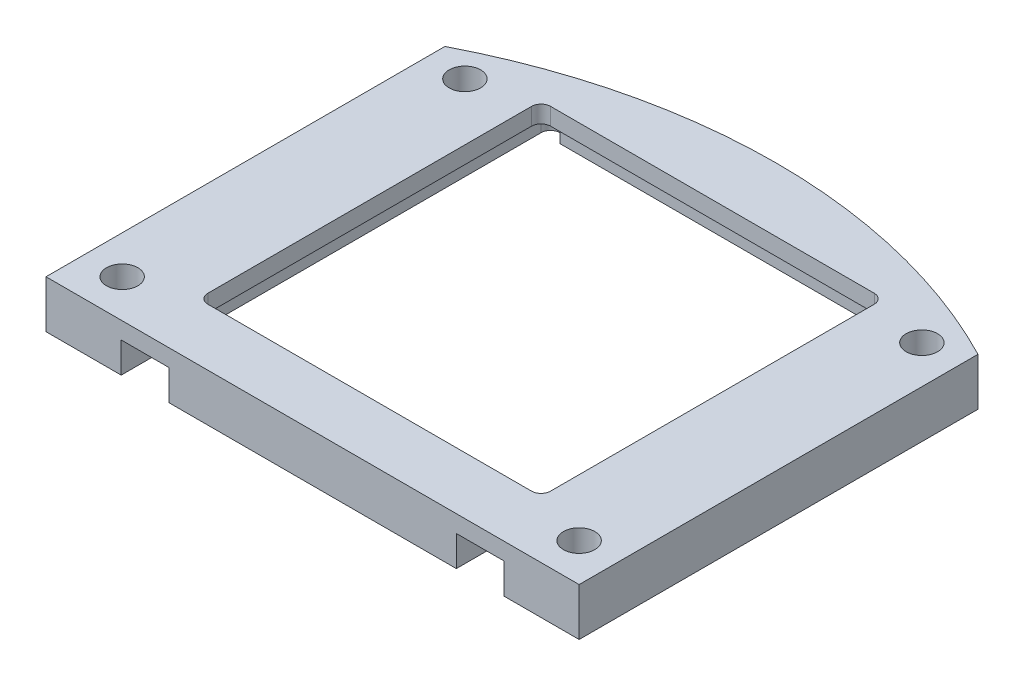
ISO-10303-21;
HEADER;
FILE_DESCRIPTION(('STEP AP214'),'2;1');
FILE_NAME('part.step','',(''),(''),'','','');
FILE_SCHEMA(('AUTOMOTIVE_DESIGN { 1 0 10303 214 1 1 1 1 }'));
ENDSEC;
DATA;
#1=APPLICATION_CONTEXT('core data for automotive mechanical design processes');
#2=APPLICATION_PROTOCOL_DEFINITION('international standard','automotive_design',2000,#1);
#3=PRODUCT_CONTEXT('',#1,'mechanical');
#4=PRODUCT('Part','Part','',(#3));
#5=PRODUCT_RELATED_PRODUCT_CATEGORY('part','',(#4));
#6=PRODUCT_DEFINITION_FORMATION('','',#4);
#7=PRODUCT_DEFINITION_CONTEXT('part definition',#1,'design');
#8=PRODUCT_DEFINITION('design','',#6,#7);
#9=PRODUCT_DEFINITION_SHAPE('','',#8);
#10=(LENGTH_UNIT() NAMED_UNIT(*) SI_UNIT(.MILLI.,.METRE.));
#11=(NAMED_UNIT(*) PLANE_ANGLE_UNIT() SI_UNIT($,.RADIAN.));
#12=(NAMED_UNIT(*) SI_UNIT($,.STERADIAN.) SOLID_ANGLE_UNIT());
#13=UNCERTAINTY_MEASURE_WITH_UNIT(LENGTH_MEASURE(1.E-05),#10,'distance_accuracy_value','');
#14=(GEOMETRIC_REPRESENTATION_CONTEXT(3) GLOBAL_UNCERTAINTY_ASSIGNED_CONTEXT((#13)) GLOBAL_UNIT_ASSIGNED_CONTEXT((#10,
#11,#12)) REPRESENTATION_CONTEXT('',''));
#15=CARTESIAN_POINT('',(0.,0.,0.));
#16=DIRECTION('',(0.,0.,1.));
#17=DIRECTION('',(1.,0.,0.));
#18=AXIS2_PLACEMENT_3D('',#15,#16,#17);
#19=CARTESIAN_POINT('',(0.,0.,36.3));
#20=DIRECTION('',(0.,1.,0.));
#21=DIRECTION('',(0.,0.,1.));
#22=AXIS2_PLACEMENT_3D('',#19,#20,#21);
#23=PLANE('',#22);
#24=CARTESIAN_POINT('',(24.,0.,20.));
#25=DIRECTION('',(0.,1.,0.));
#26=DIRECTION('',(0.,0.,1.));
#27=AXIS2_PLACEMENT_3D('',#24,#25,#26);
#28=CIRCLE('',#27,1.65);
#29=CARTESIAN_POINT('',(24.,0.,21.65));
#30=VERTEX_POINT('',#29);
#31=EDGE_CURVE('E422',#30,#30,#28,.T.);
#32=ORIENTED_EDGE('',*,*,#31,.T.);
#33=EDGE_LOOP('',(#32));
#34=FACE_BOUND('',#33,.T.);
#35=CARTESIAN_POINT('',(-24.,0.,20.));
#36=DIRECTION('',(0.,1.,0.));
#37=DIRECTION('',(0.,0.,1.));
#38=AXIS2_PLACEMENT_3D('',#35,#36,#37);
#39=CIRCLE('',#38,1.65);
#40=CARTESIAN_POINT('',(-24.,0.,21.65));
#41=VERTEX_POINT('',#40);
#42=EDGE_CURVE('E426',#41,#41,#39,.T.);
#43=ORIENTED_EDGE('',*,*,#42,.T.);
#44=EDGE_LOOP('',(#43));
#45=FACE_BOUND('',#44,.T.);
#46=CARTESIAN_POINT('',(24.,0.,-16.));
#47=DIRECTION('',(0.,1.,0.));
#48=DIRECTION('',(0.,0.,1.));
#49=AXIS2_PLACEMENT_3D('',#46,#47,#48);
#50=CIRCLE('',#49,1.65);
#51=CARTESIAN_POINT('',(24.,0.,-14.35));
#52=VERTEX_POINT('',#51);
#53=EDGE_CURVE('E432',#52,#52,#50,.T.);
#54=ORIENTED_EDGE('',*,*,#53,.T.);
#55=EDGE_LOOP('',(#54));
#56=FACE_BOUND('',#55,.T.);
#57=CARTESIAN_POINT('',(-24.,0.,-16.));
#58=DIRECTION('',(0.,1.,0.));
#59=DIRECTION('',(0.,0.,1.));
#60=AXIS2_PLACEMENT_3D('',#57,#58,#59);
#61=CIRCLE('',#60,1.65);
#62=CARTESIAN_POINT('',(-24.,0.,-14.35));
#63=VERTEX_POINT('',#62);
#64=EDGE_CURVE('E438',#63,#63,#61,.T.);
#65=ORIENTED_EDGE('',*,*,#64,.T.);
#66=EDGE_LOOP('',(#65));
#67=FACE_BOUND('',#66,.T.);
#68=CARTESIAN_POINT('',(-19.1,0.,-20.1));
#69=DIRECTION('',(0.,1.,0.));
#70=DIRECTION('',(0.,0.,1.));
#71=AXIS2_PLACEMENT_3D('',#68,#69,#70);
#72=CIRCLE('',#71,1.);
#73=CARTESIAN_POINT('',(-18.1,0.,-20.1));
#74=VERTEX_POINT('',#73);
#75=CARTESIAN_POINT('',(-19.1,0.,-21.1));
#76=VERTEX_POINT('',#75);
#77=EDGE_CURVE('E56',#74,#76,#72,.T.);
#78=ORIENTED_EDGE('',*,*,#77,.T.);
#79=CARTESIAN_POINT('',(-19.1,0.,-20.1));
#80=DIRECTION('',(0.,1.,0.));
#81=DIRECTION('',(0.,0.,1.));
#82=AXIS2_PLACEMENT_3D('',#79,#80,#81);
#83=CIRCLE('',#82,1.);
#84=CARTESIAN_POINT('',(-20.1,0.,-20.1));
#85=VERTEX_POINT('',#84);
#86=EDGE_CURVE('E310',#76,#85,#83,.T.);
#87=ORIENTED_EDGE('',*,*,#86,.T.);
#88=DIRECTION('',(0.,0.,1.));
#89=VECTOR('',#88,1.);
#90=CARTESIAN_POINT('',(-20.1,0.,-21.1));
#91=LINE('',#90,#89);
#92=CARTESIAN_POINT('',(-20.1,0.,24.));
#93=VERTEX_POINT('',#92);
#94=EDGE_CURVE('E227',#85,#93,#91,.T.);
#95=ORIENTED_EDGE('',*,*,#94,.T.);
#96=DIRECTION('',(1.,0.,0.));
#97=VECTOR('',#96,1.);
#98=CARTESIAN_POINT('',(-28.,0.,24.));
#99=LINE('',#98,#97);
#100=CARTESIAN_POINT('',(-28.,0.,24.));
#101=VERTEX_POINT('',#100);
#102=EDGE_CURVE('E247',#101,#93,#99,.T.);
#103=ORIENTED_EDGE('',*,*,#102,.F.);
#104=DIRECTION('',(0.,0.,1.));
#105=VECTOR('',#104,1.);
#106=CARTESIAN_POINT('',(-28.,0.,24.));
#107=LINE('',#106,#105);
#108=CARTESIAN_POINT('',(-28.,0.,-17.8957039195818));
#109=VERTEX_POINT('',#108);
#110=EDGE_CURVE('E258',#109,#101,#107,.T.);
#111=ORIENTED_EDGE('',*,*,#110,.F.);
#112=CARTESIAN_POINT('',(0.,0.,36.3));
#113=DIRECTION('',(0.,1.,0.));
#114=DIRECTION('',(0.,0.,1.));
#115=AXIS2_PLACEMENT_3D('',#112,#113,#114);
#116=CIRCLE('',#115,61.0014288630928);
#117=CARTESIAN_POINT('',(28.,0.,-17.8957039195818));
#118=VERTEX_POINT('',#117);
#119=EDGE_CURVE('E256',#118,#109,#116,.T.);
#120=ORIENTED_EDGE('',*,*,#119,.F.);
#121=DIRECTION('',(0.,0.,-1.));
#122=VECTOR('',#121,1.);
#123=CARTESIAN_POINT('',(28.,0.,24.));
#124=LINE('',#123,#122);
#125=CARTESIAN_POINT('',(28.,0.,24.));
#126=VERTEX_POINT('',#125);
#127=EDGE_CURVE('E242',#126,#118,#124,.T.);
#128=ORIENTED_EDGE('',*,*,#127,.F.);
#129=CARTESIAN_POINT('',(20.1,0.,24.));
#130=VERTEX_POINT('',#129);
#131=EDGE_CURVE('E260',#130,#126,#99,.T.);
#132=ORIENTED_EDGE('',*,*,#131,.F.);
#133=DIRECTION('',(0.,0.,-1.));
#134=VECTOR('',#133,1.);
#135=CARTESIAN_POINT('',(20.1,0.,20.1));
#136=LINE('',#135,#134);
#137=CARTESIAN_POINT('',(20.1,0.,-20.1));
#138=VERTEX_POINT('',#137);
#139=EDGE_CURVE('E226',#130,#138,#136,.T.);
#140=ORIENTED_EDGE('',*,*,#139,.T.);
#141=CARTESIAN_POINT('',(19.1,0.,-20.1));
#142=DIRECTION('',(0.,1.,0.));
#143=DIRECTION('',(0.,0.,1.));
#144=AXIS2_PLACEMENT_3D('',#141,#142,#143);
#145=CIRCLE('',#144,1.);
#146=CARTESIAN_POINT('',(19.1,0.,-21.1));
#147=VERTEX_POINT('',#146);
#148=EDGE_CURVE('E63',#138,#147,#145,.T.);
#149=ORIENTED_EDGE('',*,*,#148,.T.);
#150=CARTESIAN_POINT('',(19.1,0.,-20.1));
#151=DIRECTION('',(0.,1.,0.));
#152=DIRECTION('',(0.,0.,1.));
#153=AXIS2_PLACEMENT_3D('',#150,#151,#152);
#154=CIRCLE('',#153,1.);
#155=CARTESIAN_POINT('',(18.1,0.,-20.1));
#156=VERTEX_POINT('',#155);
#157=EDGE_CURVE('E306',#147,#156,#154,.T.);
#158=ORIENTED_EDGE('',*,*,#157,.T.);
#159=DIRECTION('',(-1.,0.,0.));
#160=VECTOR('',#159,1.);
#161=CARTESIAN_POINT('',(-18.1,0.,-20.1));
#162=LINE('',#161,#160);
#163=EDGE_CURVE('E229',#156,#74,#162,.T.);
#164=ORIENTED_EDGE('',*,*,#163,.T.);
#165=EDGE_LOOP('',(#78,#87,#95,#103,#111,#120,#128,#132,#140,#149,#158,#164));
#166=FACE_BOUND('',#165,.T.);
#167=ADVANCED_FACE('F39',(#34,#45,#56,#67,#166),#23,.F.);
#168=CARTESIAN_POINT('',(-20.1,5.,-21.1));
#169=DIRECTION('',(1.,0.,0.));
#170=DIRECTION('',(0.,0.,-1.));
#171=AXIS2_PLACEMENT_3D('',#168,#169,#170);
#172=PLANE('',#171);
#173=ORIENTED_EDGE('',*,*,#94,.F.);
#174=DIRECTION('',(0.,-1.,0.));
#175=VECTOR('',#174,1.);
#176=CARTESIAN_POINT('',(-20.1,3.2,-20.1));
#177=LINE('',#176,#175);
#178=CARTESIAN_POINT('',(-20.1,3.2,-20.1));
#179=VERTEX_POINT('',#178);
#180=EDGE_CURVE('E284',#85,#179,#177,.F.);
#181=ORIENTED_EDGE('',*,*,#180,.T.);
#182=DIRECTION('',(0.,0.,1.));
#183=VECTOR('',#182,1.);
#184=CARTESIAN_POINT('',(-20.1,3.2,-21.1));
#185=LINE('',#184,#183);
#186=CARTESIAN_POINT('',(-20.1,3.2,24.));
#187=VERTEX_POINT('',#186);
#188=EDGE_CURVE('E348',#179,#187,#185,.T.);
#189=ORIENTED_EDGE('',*,*,#188,.T.);
#190=DIRECTION('',(0.,-1.,0.));
#191=VECTOR('',#190,1.);
#192=CARTESIAN_POINT('',(-20.1,0.,24.));
#193=LINE('',#192,#191);
#194=EDGE_CURVE('E221',#187,#93,#193,.T.);
#195=ORIENTED_EDGE('',*,*,#194,.T.);
#196=EDGE_LOOP('',(#173,#181,#189,#195));
#197=FACE_BOUND('',#196,.T.);
#198=ADVANCED_FACE('F345',(#197),#172,.T.);
#199=CARTESIAN_POINT('',(-20.1,5.,20.1));
#200=DIRECTION('',(0.,0.,-1.));
#201=DIRECTION('',(-1.,0.,0.));
#202=AXIS2_PLACEMENT_3D('',#199,#200,#201);
#203=PLANE('',#202);
#204=DIRECTION('',(0.,1.,0.));
#205=VECTOR('',#204,1.);
#206=CARTESIAN_POINT('',(-15.1,0.,20.1));
#207=LINE('',#206,#205);
#208=CARTESIAN_POINT('',(-15.1,0.,20.1));
#209=VERTEX_POINT('',#208);
#210=CARTESIAN_POINT('',(-15.1,3.2,20.1));
#211=VERTEX_POINT('',#210);
#212=EDGE_CURVE('E200',#209,#211,#207,.T.);
#213=ORIENTED_EDGE('',*,*,#212,.T.);
#214=DIRECTION('',(1.,0.,0.));
#215=VECTOR('',#214,1.);
#216=CARTESIAN_POINT('',(-20.1,3.2,20.1));
#217=LINE('',#216,#215);
#218=CARTESIAN_POINT('',(15.1,3.2,20.1));
#219=VERTEX_POINT('',#218);
#220=EDGE_CURVE('E414',#211,#219,#217,.T.);
#221=ORIENTED_EDGE('',*,*,#220,.T.);
#222=DIRECTION('',(0.,-1.,0.));
#223=VECTOR('',#222,1.);
#224=CARTESIAN_POINT('',(15.1,0.,20.1));
#225=LINE('',#224,#223);
#226=CARTESIAN_POINT('',(15.1,0.,20.1));
#227=VERTEX_POINT('',#226);
#228=EDGE_CURVE('E211',#219,#227,#225,.T.);
#229=ORIENTED_EDGE('',*,*,#228,.T.);
#230=DIRECTION('',(1.,0.,0.));
#231=VECTOR('',#230,1.);
#232=CARTESIAN_POINT('',(-20.1,0.,20.1));
#233=LINE('',#232,#231);
#234=EDGE_CURVE('E218',#209,#227,#233,.T.);
#235=ORIENTED_EDGE('',*,*,#234,.F.);
#236=EDGE_LOOP('',(#213,#221,#229,#235));
#237=FACE_BOUND('',#236,.T.);
#238=ADVANCED_FACE('F224',(#237),#203,.T.);
#239=CARTESIAN_POINT('',(20.1,5.,20.1));
#240=DIRECTION('',(-1.,0.,0.));
#241=DIRECTION('',(0.,0.,1.));
#242=AXIS2_PLACEMENT_3D('',#239,#240,#241);
#243=PLANE('',#242);
#244=DIRECTION('',(0.,0.,-1.));
#245=VECTOR('',#244,1.);
#246=CARTESIAN_POINT('',(20.1,3.2,20.1));
#247=LINE('',#246,#245);
#248=CARTESIAN_POINT('',(20.1,3.2,24.));
#249=VERTEX_POINT('',#248);
#250=CARTESIAN_POINT('',(20.1,3.2,-20.1));
#251=VERTEX_POINT('',#250);
#252=EDGE_CURVE('E416',#249,#251,#247,.T.);
#253=ORIENTED_EDGE('',*,*,#252,.T.);
#254=DIRECTION('',(0.,-1.,0.));
#255=VECTOR('',#254,1.);
#256=CARTESIAN_POINT('',(20.1,0.,-20.1));
#257=LINE('',#256,#255);
#258=EDGE_CURVE('E282',#251,#138,#257,.T.);
#259=ORIENTED_EDGE('',*,*,#258,.T.);
#260=ORIENTED_EDGE('',*,*,#139,.F.);
#261=DIRECTION('',(0.,1.,0.));
#262=VECTOR('',#261,1.);
#263=CARTESIAN_POINT('',(20.1,0.,24.));
#264=LINE('',#263,#262);
#265=EDGE_CURVE('E383',#130,#249,#264,.T.);
#266=ORIENTED_EDGE('',*,*,#265,.T.);
#267=EDGE_LOOP('',(#253,#259,#260,#266));
#268=FACE_BOUND('',#267,.T.);
#269=ADVANCED_FACE('F485',(#268),#243,.T.);
#270=CARTESIAN_POINT('',(-18.1,5.,-20.1));
#271=DIRECTION('',(0.,0.,1.));
#272=DIRECTION('',(1.,0.,0.));
#273=AXIS2_PLACEMENT_3D('',#270,#271,#272);
#274=PLANE('',#273);
#275=DIRECTION('',(0.,-1.,0.));
#276=VECTOR('',#275,1.);
#277=CARTESIAN_POINT('',(18.1,5.,-20.1));
#278=LINE('',#277,#276);
#279=CARTESIAN_POINT('',(18.1,3.2,-20.1));
#280=VERTEX_POINT('',#279);
#281=EDGE_CURVE('E239',#280,#156,#278,.T.);
#282=ORIENTED_EDGE('',*,*,#281,.F.);
#283=DIRECTION('',(-1.,0.,0.));
#284=VECTOR('',#283,1.);
#285=CARTESIAN_POINT('',(18.1,3.2,-20.1));
#286=LINE('',#285,#284);
#287=CARTESIAN_POINT('',(-18.1,3.2,-20.1));
#288=VERTEX_POINT('',#287);
#289=EDGE_CURVE('E419',#280,#288,#286,.T.);
#290=ORIENTED_EDGE('',*,*,#289,.T.);
#291=DIRECTION('',(0.,-1.,0.));
#292=VECTOR('',#291,1.);
#293=CARTESIAN_POINT('',(-18.1,5.,-20.1));
#294=LINE('',#293,#292);
#295=EDGE_CURVE('E236',#288,#74,#294,.T.);
#296=ORIENTED_EDGE('',*,*,#295,.T.);
#297=ORIENTED_EDGE('',*,*,#163,.F.);
#298=EDGE_LOOP('',(#282,#290,#296,#297));
#299=FACE_BOUND('',#298,.T.);
#300=ADVANCED_FACE('F479',(#299),#274,.T.);
#301=CARTESIAN_POINT('',(0.,5.,36.3));
#302=DIRECTION('',(0.,1.,0.));
#303=DIRECTION('',(0.,0.,1.));
#304=AXIS2_PLACEMENT_3D('',#301,#302,#303);
#305=PLANE('',#304);
#306=CARTESIAN_POINT('',(-24.,5.,20.));
#307=DIRECTION('',(0.,1.,0.));
#308=DIRECTION('',(0.,0.,1.));
#309=AXIS2_PLACEMENT_3D('',#306,#307,#308);
#310=CIRCLE('',#309,1.65);
#311=CARTESIAN_POINT('',(-24.,5.,21.65));
#312=VERTEX_POINT('',#311);
#313=EDGE_CURVE('E429',#312,#312,#310,.T.);
#314=ORIENTED_EDGE('',*,*,#313,.F.);
#315=EDGE_LOOP('',(#314));
#316=FACE_BOUND('',#315,.T.);
#317=CARTESIAN_POINT('',(-24.,5.,-16.));
#318=DIRECTION('',(0.,1.,0.));
#319=DIRECTION('',(0.,0.,1.));
#320=AXIS2_PLACEMENT_3D('',#317,#318,#319);
#321=CIRCLE('',#320,1.65);
#322=CARTESIAN_POINT('',(-24.,5.,-14.35));
#323=VERTEX_POINT('',#322);
#324=EDGE_CURVE('E231',#323,#323,#321,.T.);
#325=ORIENTED_EDGE('',*,*,#324,.F.);
#326=EDGE_LOOP('',(#325));
#327=FACE_BOUND('',#326,.T.);
#328=DIRECTION('',(0.,0.,-1.));
#329=VECTOR('',#328,1.);
#330=CARTESIAN_POINT('',(28.,5.,24.));
#331=LINE('',#330,#329);
#332=CARTESIAN_POINT('',(28.,5.,24.));
#333=VERTEX_POINT('',#332);
#334=CARTESIAN_POINT('',(28.,5.,-17.8957039195818));
#335=VERTEX_POINT('',#334);
#336=EDGE_CURVE('E243',#333,#335,#331,.T.);
#337=ORIENTED_EDGE('',*,*,#336,.T.);
#338=CARTESIAN_POINT('',(0.,5.,36.3));
#339=DIRECTION('',(0.,1.,0.));
#340=DIRECTION('',(0.,0.,1.));
#341=AXIS2_PLACEMENT_3D('',#338,#339,#340);
#342=CIRCLE('',#341,61.0014288630928);
#343=CARTESIAN_POINT('',(-28.,5.,-17.8957039195818));
#344=VERTEX_POINT('',#343);
#345=EDGE_CURVE('E246',#335,#344,#342,.T.);
#346=ORIENTED_EDGE('',*,*,#345,.T.);
#347=DIRECTION('',(0.,0.,1.));
#348=VECTOR('',#347,1.);
#349=CARTESIAN_POINT('',(-28.,5.,24.));
#350=LINE('',#349,#348);
#351=CARTESIAN_POINT('',(-28.,5.,24.));
#352=VERTEX_POINT('',#351);
#353=EDGE_CURVE('E249',#344,#352,#350,.T.);
#354=ORIENTED_EDGE('',*,*,#353,.T.);
#355=DIRECTION('',(1.,0.,0.));
#356=VECTOR('',#355,1.);
#357=CARTESIAN_POINT('',(-28.,5.,24.));
#358=LINE('',#357,#356);
#359=EDGE_CURVE('E251',#352,#333,#358,.T.);
#360=ORIENTED_EDGE('',*,*,#359,.T.);
#361=EDGE_LOOP('',(#337,#346,#354,#360));
#362=FACE_BOUND('',#361,.T.);
#363=CARTESIAN_POINT('',(24.,5.,-16.));
#364=DIRECTION('',(0.,1.,0.));
#365=DIRECTION('',(0.,0.,1.));
#366=AXIS2_PLACEMENT_3D('',#363,#364,#365);
#367=CIRCLE('',#366,1.65);
#368=CARTESIAN_POINT('',(24.,5.,-14.35));
#369=VERTEX_POINT('',#368);
#370=EDGE_CURVE('E435',#369,#369,#367,.T.);
#371=ORIENTED_EDGE('',*,*,#370,.F.);
#372=EDGE_LOOP('',(#371));
#373=FACE_BOUND('',#372,.T.);
#374=CARTESIAN_POINT('',(24.,5.,20.));
#375=DIRECTION('',(0.,1.,0.));
#376=DIRECTION('',(0.,0.,1.));
#377=AXIS2_PLACEMENT_3D('',#374,#375,#376);
#378=CIRCLE('',#377,1.65);
#379=CARTESIAN_POINT('',(24.,5.,21.65));
#380=VERTEX_POINT('',#379);
#381=EDGE_CURVE('E423',#380,#380,#378,.T.);
#382=ORIENTED_EDGE('',*,*,#381,.F.);
#383=EDGE_LOOP('',(#382));
#384=FACE_BOUND('',#383,.T.);
#385=DIRECTION('',(0.,0.,1.));
#386=VECTOR('',#385,1.);
#387=CARTESIAN_POINT('',(-18.,5.,-18.));
#388=LINE('',#387,#386);
#389=CARTESIAN_POINT('',(-18.,5.,-17.));
#390=VERTEX_POINT('',#389);
#391=CARTESIAN_POINT('',(-18.,5.,17.));
#392=VERTEX_POINT('',#391);
#393=EDGE_CURVE('E376',#390,#392,#388,.T.);
#394=ORIENTED_EDGE('',*,*,#393,.F.);
#395=CARTESIAN_POINT('',(-17.,5.,-17.));
#396=DIRECTION('',(0.,1.,0.));
#397=DIRECTION('',(0.,0.,1.));
#398=AXIS2_PLACEMENT_3D('',#395,#396,#397);
#399=CIRCLE('',#398,1.);
#400=CARTESIAN_POINT('',(-17.,5.,-18.));
#401=VERTEX_POINT('',#400);
#402=EDGE_CURVE('E48',#390,#401,#399,.F.);
#403=ORIENTED_EDGE('',*,*,#402,.T.);
#404=DIRECTION('',(-1.,0.,0.));
#405=VECTOR('',#404,1.);
#406=CARTESIAN_POINT('',(18.,5.,-18.));
#407=LINE('',#406,#405);
#408=CARTESIAN_POINT('',(17.,5.,-18.));
#409=VERTEX_POINT('',#408);
#410=EDGE_CURVE('E394',#409,#401,#407,.T.);
#411=ORIENTED_EDGE('',*,*,#410,.F.);
#412=CARTESIAN_POINT('',(17.,5.,-17.));
#413=DIRECTION('',(0.,1.,0.));
#414=DIRECTION('',(0.,0.,1.));
#415=AXIS2_PLACEMENT_3D('',#412,#413,#414);
#416=CIRCLE('',#415,1.);
#417=CARTESIAN_POINT('',(18.,5.,-17.));
#418=VERTEX_POINT('',#417);
#419=EDGE_CURVE('E320',#409,#418,#416,.F.);
#420=ORIENTED_EDGE('',*,*,#419,.T.);
#421=DIRECTION('',(0.,0.,-1.));
#422=VECTOR('',#421,1.);
#423=CARTESIAN_POINT('',(18.,5.,18.));
#424=LINE('',#423,#422);
#425=CARTESIAN_POINT('',(18.,5.,17.));
#426=VERTEX_POINT('',#425);
#427=EDGE_CURVE('E408',#426,#418,#424,.T.);
#428=ORIENTED_EDGE('',*,*,#427,.F.);
#429=CARTESIAN_POINT('',(17.,5.,17.));
#430=DIRECTION('',(0.,1.,0.));
#431=DIRECTION('',(0.,0.,1.));
#432=AXIS2_PLACEMENT_3D('',#429,#430,#431);
#433=CIRCLE('',#432,1.);
#434=CARTESIAN_POINT('',(17.,5.,18.));
#435=VERTEX_POINT('',#434);
#436=EDGE_CURVE('E316',#426,#435,#433,.F.);
#437=ORIENTED_EDGE('',*,*,#436,.T.);
#438=DIRECTION('',(1.,0.,0.));
#439=VECTOR('',#438,1.);
#440=CARTESIAN_POINT('',(-18.,5.,18.));
#441=LINE('',#440,#439);
#442=CARTESIAN_POINT('',(-17.,5.,18.));
#443=VERTEX_POINT('',#442);
#444=EDGE_CURVE('E405',#443,#435,#441,.T.);
#445=ORIENTED_EDGE('',*,*,#444,.F.);
#446=CARTESIAN_POINT('',(-17.,5.,17.));
#447=DIRECTION('',(0.,1.,0.));
#448=DIRECTION('',(0.,0.,1.));
#449=AXIS2_PLACEMENT_3D('',#446,#447,#448);
#450=CIRCLE('',#449,1.);
#451=EDGE_CURVE('E312',#443,#392,#450,.F.);
#452=ORIENTED_EDGE('',*,*,#451,.T.);
#453=EDGE_LOOP('',(#394,#403,#411,#420,#428,#437,#445,#452));
#454=FACE_BOUND('',#453,.T.);
#455=ADVANCED_FACE('F472',(#316,#327,#362,#373,#384,#454),#305,.T.);
#456=CARTESIAN_POINT('',(-15.1,0.,24.));
#457=VERTEX_POINT('',#456);
#458=CARTESIAN_POINT('',(15.1,0.,24.));
#459=VERTEX_POINT('',#458);
#460=EDGE_CURVE('E220',#457,#459,#99,.T.);
#461=ORIENTED_EDGE('',*,*,#460,.F.);
#462=DIRECTION('',(0.,0.,1.));
#463=VECTOR('',#462,1.);
#464=CARTESIAN_POINT('',(-15.1,0.,-24.7024288630928));
#465=LINE('',#464,#463);
#466=EDGE_CURVE('E204',#209,#457,#465,.T.);
#467=ORIENTED_EDGE('',*,*,#466,.F.);
#468=ORIENTED_EDGE('',*,*,#234,.T.);
#469=DIRECTION('',(0.,0.,1.));
#470=VECTOR('',#469,1.);
#471=CARTESIAN_POINT('',(15.1,0.,-24.7024288630928));
#472=LINE('',#471,#470);
#473=EDGE_CURVE('E382',#227,#459,#472,.T.);
#474=ORIENTED_EDGE('',*,*,#473,.T.);
#475=EDGE_LOOP('',(#461,#467,#468,#474));
#476=FACE_BOUND('',#475,.T.);
#477=ADVANCED_FACE('F216',(#476),#23,.F.);
#478=CARTESIAN_POINT('',(28.,5.,24.));
#479=DIRECTION('',(-1.,0.,0.));
#480=DIRECTION('',(0.,0.,1.));
#481=AXIS2_PLACEMENT_3D('',#478,#479,#480);
#482=PLANE('',#481);
#483=ORIENTED_EDGE('',*,*,#127,.T.);
#484=DIRECTION('',(0.,-1.,0.));
#485=VECTOR('',#484,1.);
#486=CARTESIAN_POINT('',(28.,5.,-17.8957039195818));
#487=LINE('',#486,#485);
#488=EDGE_CURVE('E271',#335,#118,#487,.T.);
#489=ORIENTED_EDGE('',*,*,#488,.F.);
#490=ORIENTED_EDGE('',*,*,#336,.F.);
#491=DIRECTION('',(0.,-1.,0.));
#492=VECTOR('',#491,1.);
#493=CARTESIAN_POINT('',(28.,5.,24.));
#494=LINE('',#493,#492);
#495=EDGE_CURVE('E253',#333,#126,#494,.T.);
#496=ORIENTED_EDGE('',*,*,#495,.T.);
#497=EDGE_LOOP('',(#483,#489,#490,#496));
#498=FACE_BOUND('',#497,.T.);
#499=ADVANCED_FACE('F368',(#498),#482,.F.);
#500=CARTESIAN_POINT('',(0.,5.,36.3));
#501=DIRECTION('',(0.,-1.,0.));
#502=DIRECTION('',(0.,0.,-1.));
#503=AXIS2_PLACEMENT_3D('',#500,#501,#502);
#504=CYLINDRICAL_SURFACE('',#503,61.0014288630928);
#505=ORIENTED_EDGE('',*,*,#119,.T.);
#506=DIRECTION('',(0.,-1.,0.));
#507=VECTOR('',#506,1.);
#508=CARTESIAN_POINT('',(-28.,5.,-17.8957039195818));
#509=LINE('',#508,#507);
#510=EDGE_CURVE('E268',#344,#109,#509,.T.);
#511=ORIENTED_EDGE('',*,*,#510,.F.);
#512=ORIENTED_EDGE('',*,*,#345,.F.);
#513=ORIENTED_EDGE('',*,*,#488,.T.);
#514=EDGE_LOOP('',(#505,#511,#512,#513));
#515=FACE_BOUND('',#514,.T.);
#516=ADVANCED_FACE('F364',(#515),#504,.T.);
#517=CARTESIAN_POINT('',(-28.,5.,24.));
#518=DIRECTION('',(1.,0.,0.));
#519=DIRECTION('',(0.,0.,-1.));
#520=AXIS2_PLACEMENT_3D('',#517,#518,#519);
#521=PLANE('',#520);
#522=ORIENTED_EDGE('',*,*,#110,.T.);
#523=DIRECTION('',(0.,-1.,0.));
#524=VECTOR('',#523,1.);
#525=CARTESIAN_POINT('',(-28.,5.,24.));
#526=LINE('',#525,#524);
#527=EDGE_CURVE('E265',#352,#101,#526,.T.);
#528=ORIENTED_EDGE('',*,*,#527,.F.);
#529=ORIENTED_EDGE('',*,*,#353,.F.);
#530=ORIENTED_EDGE('',*,*,#510,.T.);
#531=EDGE_LOOP('',(#522,#528,#529,#530));
#532=FACE_BOUND('',#531,.T.);
#533=ADVANCED_FACE('F360',(#532),#521,.F.);
#534=CARTESIAN_POINT('',(-28.,5.,24.));
#535=DIRECTION('',(0.,0.,-1.));
#536=DIRECTION('',(-1.,0.,0.));
#537=AXIS2_PLACEMENT_3D('',#534,#535,#536);
#538=PLANE('',#537);
#539=ORIENTED_EDGE('',*,*,#102,.T.);
#540=ORIENTED_EDGE('',*,*,#194,.F.);
#541=DIRECTION('',(-1.,0.,0.));
#542=VECTOR('',#541,1.);
#543=CARTESIAN_POINT('',(-20.1,3.2,24.));
#544=LINE('',#543,#542);
#545=CARTESIAN_POINT('',(-15.1,3.2,24.));
#546=VERTEX_POINT('',#545);
#547=EDGE_CURVE('E374',#546,#187,#544,.T.);
#548=ORIENTED_EDGE('',*,*,#547,.F.);
#549=DIRECTION('',(0.,1.,0.));
#550=VECTOR('',#549,1.);
#551=CARTESIAN_POINT('',(-15.1,0.,24.));
#552=LINE('',#551,#550);
#553=EDGE_CURVE('E352',#457,#546,#552,.T.);
#554=ORIENTED_EDGE('',*,*,#553,.F.);
#555=ORIENTED_EDGE('',*,*,#460,.T.);
#556=DIRECTION('',(0.,-1.,0.));
#557=VECTOR('',#556,1.);
#558=CARTESIAN_POINT('',(15.1,0.,24.));
#559=LINE('',#558,#557);
#560=CARTESIAN_POINT('',(15.1,3.2,24.));
#561=VERTEX_POINT('',#560);
#562=EDGE_CURVE('E326',#561,#459,#559,.T.);
#563=ORIENTED_EDGE('',*,*,#562,.F.);
#564=DIRECTION('',(-1.,0.,0.));
#565=VECTOR('',#564,1.);
#566=CARTESIAN_POINT('',(20.1,3.2,24.));
#567=LINE('',#566,#565);
#568=EDGE_CURVE('E329',#249,#561,#567,.T.);
#569=ORIENTED_EDGE('',*,*,#568,.F.);
#570=ORIENTED_EDGE('',*,*,#265,.F.);
#571=ORIENTED_EDGE('',*,*,#131,.T.);
#572=ORIENTED_EDGE('',*,*,#495,.F.);
#573=ORIENTED_EDGE('',*,*,#359,.F.);
#574=ORIENTED_EDGE('',*,*,#527,.T.);
#575=EDGE_LOOP('',(#539,#540,#548,#554,#555,#563,#569,#570,#571,#572,#573,#574));
#576=FACE_BOUND('',#575,.T.);
#577=ADVANCED_FACE('F354',(#576),#538,.F.);
#578=CARTESIAN_POINT('',(-24.,5.,-16.));
#579=DIRECTION('',(0.,-1.,0.));
#580=DIRECTION('',(0.,0.,-1.));
#581=AXIS2_PLACEMENT_3D('',#578,#579,#580);
#582=CYLINDRICAL_SURFACE('',#581,1.65);
#583=ORIENTED_EDGE('',*,*,#324,.T.);
#584=EDGE_LOOP('',(#583));
#585=FACE_BOUND('',#584,.T.);
#586=ORIENTED_EDGE('',*,*,#64,.F.);
#587=EDGE_LOOP('',(#586));
#588=FACE_BOUND('',#587,.T.);
#589=ADVANCED_FACE('F446',(#585,#588),#582,.F.);
#590=CARTESIAN_POINT('',(24.,5.,-16.));
#591=DIRECTION('',(0.,-1.,0.));
#592=DIRECTION('',(0.,0.,-1.));
#593=AXIS2_PLACEMENT_3D('',#590,#591,#592);
#594=CYLINDRICAL_SURFACE('',#593,1.65);
#595=ORIENTED_EDGE('',*,*,#370,.T.);
#596=EDGE_LOOP('',(#595));
#597=FACE_BOUND('',#596,.T.);
#598=ORIENTED_EDGE('',*,*,#53,.F.);
#599=EDGE_LOOP('',(#598));
#600=FACE_BOUND('',#599,.T.);
#601=ADVANCED_FACE('F448',(#597,#600),#594,.F.);
#602=CARTESIAN_POINT('',(-24.,5.,20.));
#603=DIRECTION('',(0.,-1.,0.));
#604=DIRECTION('',(0.,0.,-1.));
#605=AXIS2_PLACEMENT_3D('',#602,#603,#604);
#606=CYLINDRICAL_SURFACE('',#605,1.65);
#607=ORIENTED_EDGE('',*,*,#313,.T.);
#608=EDGE_LOOP('',(#607));
#609=FACE_BOUND('',#608,.T.);
#610=ORIENTED_EDGE('',*,*,#42,.F.);
#611=EDGE_LOOP('',(#610));
#612=FACE_BOUND('',#611,.T.);
#613=ADVANCED_FACE('F455',(#609,#612),#606,.F.);
#614=CARTESIAN_POINT('',(24.,5.,20.));
#615=DIRECTION('',(0.,-1.,0.));
#616=DIRECTION('',(0.,0.,-1.));
#617=AXIS2_PLACEMENT_3D('',#614,#615,#616);
#618=CYLINDRICAL_SURFACE('',#617,1.65);
#619=ORIENTED_EDGE('',*,*,#381,.T.);
#620=EDGE_LOOP('',(#619));
#621=FACE_BOUND('',#620,.T.);
#622=ORIENTED_EDGE('',*,*,#31,.F.);
#623=EDGE_LOOP('',(#622));
#624=FACE_BOUND('',#623,.T.);
#625=ADVANCED_FACE('F530',(#621,#624),#618,.F.);
#626=CARTESIAN_POINT('',(0.,3.2,0.));
#627=DIRECTION('',(0.,1.,0.));
#628=DIRECTION('',(0.,0.,1.));
#629=AXIS2_PLACEMENT_3D('',#626,#627,#628);
#630=PLANE('',#629);
#631=DIRECTION('',(0.,0.,-1.));
#632=VECTOR('',#631,1.);
#633=CARTESIAN_POINT('',(18.,3.2,18.));
#634=LINE('',#633,#632);
#635=CARTESIAN_POINT('',(18.,3.2,17.));
#636=VERTEX_POINT('',#635);
#637=CARTESIAN_POINT('',(18.,3.2,-17.));
#638=VERTEX_POINT('',#637);
#639=EDGE_CURVE('E397',#636,#638,#634,.T.);
#640=ORIENTED_EDGE('',*,*,#639,.T.);
#641=CARTESIAN_POINT('',(17.,3.2,-17.));
#642=DIRECTION('',(0.,1.,0.));
#643=DIRECTION('',(0.,0.,1.));
#644=AXIS2_PLACEMENT_3D('',#641,#642,#643);
#645=CIRCLE('',#644,1.);
#646=CARTESIAN_POINT('',(17.,3.2,-18.));
#647=VERTEX_POINT('',#646);
#648=EDGE_CURVE('E322',#638,#647,#645,.T.);
#649=ORIENTED_EDGE('',*,*,#648,.T.);
#650=DIRECTION('',(-1.,0.,0.));
#651=VECTOR('',#650,1.);
#652=CARTESIAN_POINT('',(18.,3.2,-18.));
#653=LINE('',#652,#651);
#654=CARTESIAN_POINT('',(-17.,3.2,-18.));
#655=VERTEX_POINT('',#654);
#656=EDGE_CURVE('E400',#647,#655,#653,.T.);
#657=ORIENTED_EDGE('',*,*,#656,.T.);
#658=CARTESIAN_POINT('',(-17.,3.2,-17.));
#659=DIRECTION('',(0.,1.,0.));
#660=DIRECTION('',(0.,0.,1.));
#661=AXIS2_PLACEMENT_3D('',#658,#659,#660);
#662=CIRCLE('',#661,1.);
#663=CARTESIAN_POINT('',(-18.,3.2,-17.));
#664=VERTEX_POINT('',#663);
#665=EDGE_CURVE('E11',#655,#664,#662,.T.);
#666=ORIENTED_EDGE('',*,*,#665,.T.);
#667=DIRECTION('',(0.,0.,1.));
#668=VECTOR('',#667,1.);
#669=CARTESIAN_POINT('',(-18.,3.2,-18.));
#670=LINE('',#669,#668);
#671=CARTESIAN_POINT('',(-18.,3.2,17.));
#672=VERTEX_POINT('',#671);
#673=EDGE_CURVE('E390',#664,#672,#670,.T.);
#674=ORIENTED_EDGE('',*,*,#673,.T.);
#675=CARTESIAN_POINT('',(-17.,3.2,17.));
#676=DIRECTION('',(0.,1.,0.));
#677=DIRECTION('',(0.,0.,1.));
#678=AXIS2_PLACEMENT_3D('',#675,#676,#677);
#679=CIRCLE('',#678,1.);
#680=CARTESIAN_POINT('',(-17.,3.2,18.));
#681=VERTEX_POINT('',#680);
#682=EDGE_CURVE('E314',#672,#681,#679,.T.);
#683=ORIENTED_EDGE('',*,*,#682,.T.);
#684=DIRECTION('',(1.,0.,0.));
#685=VECTOR('',#684,1.);
#686=CARTESIAN_POINT('',(-18.,3.2,18.));
#687=LINE('',#686,#685);
#688=CARTESIAN_POINT('',(17.,3.2,18.));
#689=VERTEX_POINT('',#688);
#690=EDGE_CURVE('E393',#681,#689,#687,.T.);
#691=ORIENTED_EDGE('',*,*,#690,.T.);
#692=CARTESIAN_POINT('',(17.,3.2,17.));
#693=DIRECTION('',(0.,1.,0.));
#694=DIRECTION('',(0.,0.,1.));
#695=AXIS2_PLACEMENT_3D('',#692,#693,#694);
#696=CIRCLE('',#695,1.);
#697=EDGE_CURVE('E318',#689,#636,#696,.T.);
#698=ORIENTED_EDGE('',*,*,#697,.T.);
#699=EDGE_LOOP('',(#640,#649,#657,#666,#674,#683,#691,#698));
#700=FACE_BOUND('',#699,.T.);
#701=ORIENTED_EDGE('',*,*,#289,.F.);
#702=CARTESIAN_POINT('',(19.1,3.2,-20.1));
#703=DIRECTION('',(0.,1.,0.));
#704=DIRECTION('',(0.,0.,1.));
#705=AXIS2_PLACEMENT_3D('',#702,#703,#704);
#706=CIRCLE('',#705,1.);
#707=CARTESIAN_POINT('',(19.1,3.2,-21.1));
#708=VERTEX_POINT('',#707);
#709=EDGE_CURVE('E280',#280,#708,#706,.F.);
#710=ORIENTED_EDGE('',*,*,#709,.T.);
#711=CARTESIAN_POINT('',(19.1,3.2,-20.1));
#712=DIRECTION('',(0.,1.,0.));
#713=DIRECTION('',(0.,0.,1.));
#714=AXIS2_PLACEMENT_3D('',#711,#712,#713);
#715=CIRCLE('',#714,1.);
#716=EDGE_CURVE('E278',#708,#251,#715,.F.);
#717=ORIENTED_EDGE('',*,*,#716,.T.);
#718=ORIENTED_EDGE('',*,*,#252,.F.);
#719=ORIENTED_EDGE('',*,*,#568,.T.);
#720=DIRECTION('',(0.,0.,1.));
#721=VECTOR('',#720,1.);
#722=CARTESIAN_POINT('',(15.1,3.2,-24.7024288630928));
#723=LINE('',#722,#721);
#724=EDGE_CURVE('E380',#219,#561,#723,.T.);
#725=ORIENTED_EDGE('',*,*,#724,.F.);
#726=ORIENTED_EDGE('',*,*,#220,.F.);
#727=DIRECTION('',(0.,0.,1.));
#728=VECTOR('',#727,1.);
#729=CARTESIAN_POINT('',(-15.1,3.2,-24.7024288630928));
#730=LINE('',#729,#728);
#731=EDGE_CURVE('E206',#211,#546,#730,.T.);
#732=ORIENTED_EDGE('',*,*,#731,.T.);
#733=ORIENTED_EDGE('',*,*,#547,.T.);
#734=ORIENTED_EDGE('',*,*,#188,.F.);
#735=CARTESIAN_POINT('',(-19.1,3.2,-20.1));
#736=DIRECTION('',(0.,1.,0.));
#737=DIRECTION('',(0.,0.,1.));
#738=AXIS2_PLACEMENT_3D('',#735,#736,#737);
#739=CIRCLE('',#738,1.);
#740=CARTESIAN_POINT('',(-19.1,3.2,-21.1));
#741=VERTEX_POINT('',#740);
#742=EDGE_CURVE('E274',#179,#741,#739,.F.);
#743=ORIENTED_EDGE('',*,*,#742,.T.);
#744=CARTESIAN_POINT('',(-19.1,3.2,-20.1));
#745=DIRECTION('',(0.,1.,0.));
#746=DIRECTION('',(0.,0.,1.));
#747=AXIS2_PLACEMENT_3D('',#744,#745,#746);
#748=CIRCLE('',#747,1.);
#749=EDGE_CURVE('E276',#741,#288,#748,.F.);
#750=ORIENTED_EDGE('',*,*,#749,.T.);
#751=EDGE_LOOP('',(#701,#710,#717,#718,#719,#725,#726,#732,#733,#734,#743,#750));
#752=FACE_BOUND('',#751,.T.);
#753=ADVANCED_FACE('F504',(#700,#752),#630,.F.);
#754=CARTESIAN_POINT('',(-18.,3.2,-18.));
#755=DIRECTION('',(-1.,0.,0.));
#756=DIRECTION('',(0.,0.,1.));
#757=AXIS2_PLACEMENT_3D('',#754,#755,#756);
#758=PLANE('',#757);
#759=ORIENTED_EDGE('',*,*,#393,.T.);
#760=DIRECTION('',(0.,1.,0.));
#761=VECTOR('',#760,1.);
#762=CARTESIAN_POINT('',(-18.,3.2,17.));
#763=LINE('',#762,#761);
#764=EDGE_CURVE('E294',#392,#672,#763,.F.);
#765=ORIENTED_EDGE('',*,*,#764,.T.);
#766=ORIENTED_EDGE('',*,*,#673,.F.);
#767=DIRECTION('',(0.,1.,0.));
#768=VECTOR('',#767,1.);
#769=CARTESIAN_POINT('',(-18.,5.,-17.));
#770=LINE('',#769,#768);
#771=EDGE_CURVE('E291',#664,#390,#770,.T.);
#772=ORIENTED_EDGE('',*,*,#771,.T.);
#773=EDGE_LOOP('',(#759,#765,#766,#772));
#774=FACE_BOUND('',#773,.T.);
#775=ADVANCED_FACE('F521',(#774),#758,.F.);
#776=CARTESIAN_POINT('',(18.,3.2,-18.));
#777=DIRECTION('',(0.,0.,-1.));
#778=DIRECTION('',(-1.,0.,0.));
#779=AXIS2_PLACEMENT_3D('',#776,#777,#778);
#780=PLANE('',#779);
#781=ORIENTED_EDGE('',*,*,#656,.F.);
#782=DIRECTION('',(0.,1.,0.));
#783=VECTOR('',#782,1.);
#784=CARTESIAN_POINT('',(17.,5.,-18.));
#785=LINE('',#784,#783);
#786=EDGE_CURVE('E303',#647,#409,#785,.T.);
#787=ORIENTED_EDGE('',*,*,#786,.T.);
#788=ORIENTED_EDGE('',*,*,#410,.T.);
#789=DIRECTION('',(0.,1.,0.));
#790=VECTOR('',#789,1.);
#791=CARTESIAN_POINT('',(-17.,3.2,-18.));
#792=LINE('',#791,#790);
#793=EDGE_CURVE('E301',#401,#655,#792,.F.);
#794=ORIENTED_EDGE('',*,*,#793,.T.);
#795=EDGE_LOOP('',(#781,#787,#788,#794));
#796=FACE_BOUND('',#795,.T.);
#797=ADVANCED_FACE('F518',(#796),#780,.F.);
#798=CARTESIAN_POINT('',(18.,3.2,18.));
#799=DIRECTION('',(1.,0.,0.));
#800=DIRECTION('',(0.,0.,-1.));
#801=AXIS2_PLACEMENT_3D('',#798,#799,#800);
#802=PLANE('',#801);
#803=ORIENTED_EDGE('',*,*,#639,.F.);
#804=DIRECTION('',(0.,1.,0.));
#805=VECTOR('',#804,1.);
#806=CARTESIAN_POINT('',(18.,5.,17.));
#807=LINE('',#806,#805);
#808=EDGE_CURVE('E298',#636,#426,#807,.T.);
#809=ORIENTED_EDGE('',*,*,#808,.T.);
#810=ORIENTED_EDGE('',*,*,#427,.T.);
#811=DIRECTION('',(0.,1.,0.));
#812=VECTOR('',#811,1.);
#813=CARTESIAN_POINT('',(18.,3.2,-17.));
#814=LINE('',#813,#812);
#815=EDGE_CURVE('E296',#418,#638,#814,.F.);
#816=ORIENTED_EDGE('',*,*,#815,.T.);
#817=EDGE_LOOP('',(#803,#809,#810,#816));
#818=FACE_BOUND('',#817,.T.);
#819=ADVANCED_FACE('F514',(#818),#802,.F.);
#820=CARTESIAN_POINT('',(-18.,3.2,18.));
#821=DIRECTION('',(0.,0.,1.));
#822=DIRECTION('',(1.,0.,0.));
#823=AXIS2_PLACEMENT_3D('',#820,#821,#822);
#824=PLANE('',#823);
#825=ORIENTED_EDGE('',*,*,#690,.F.);
#826=DIRECTION('',(0.,1.,0.));
#827=VECTOR('',#826,1.);
#828=CARTESIAN_POINT('',(-17.,5.,18.));
#829=LINE('',#828,#827);
#830=EDGE_CURVE('E288',#681,#443,#829,.T.);
#831=ORIENTED_EDGE('',*,*,#830,.T.);
#832=ORIENTED_EDGE('',*,*,#444,.T.);
#833=DIRECTION('',(0.,1.,0.));
#834=VECTOR('',#833,1.);
#835=CARTESIAN_POINT('',(17.,3.2,18.));
#836=LINE('',#835,#834);
#837=EDGE_CURVE('E286',#435,#689,#836,.F.);
#838=ORIENTED_EDGE('',*,*,#837,.T.);
#839=EDGE_LOOP('',(#825,#831,#832,#838));
#840=FACE_BOUND('',#839,.T.);
#841=ADVANCED_FACE('F508',(#840),#824,.F.);
#842=CARTESIAN_POINT('',(15.1,0.,-24.7024288630928));
#843=DIRECTION('',(-1.,0.,0.));
#844=DIRECTION('',(0.,0.,1.));
#845=AXIS2_PLACEMENT_3D('',#842,#843,#844);
#846=PLANE('',#845);
#847=ORIENTED_EDGE('',*,*,#724,.T.);
#848=ORIENTED_EDGE('',*,*,#562,.T.);
#849=ORIENTED_EDGE('',*,*,#473,.F.);
#850=ORIENTED_EDGE('',*,*,#228,.F.);
#851=EDGE_LOOP('',(#847,#848,#849,#850));
#852=FACE_BOUND('',#851,.T.);
#853=ADVANCED_FACE('F506',(#852),#846,.F.);
#854=CARTESIAN_POINT('',(-15.1,0.,-24.7024288630928));
#855=DIRECTION('',(1.,0.,0.));
#856=DIRECTION('',(0.,0.,-1.));
#857=AXIS2_PLACEMENT_3D('',#854,#855,#856);
#858=PLANE('',#857);
#859=ORIENTED_EDGE('',*,*,#466,.T.);
#860=ORIENTED_EDGE('',*,*,#553,.T.);
#861=ORIENTED_EDGE('',*,*,#731,.F.);
#862=ORIENTED_EDGE('',*,*,#212,.F.);
#863=EDGE_LOOP('',(#859,#860,#861,#862));
#864=FACE_BOUND('',#863,.T.);
#865=ADVANCED_FACE('F202',(#864),#858,.F.);
#866=CARTESIAN_POINT('',(19.1,5.,-20.1));
#867=DIRECTION('',(0.,1.,0.));
#868=DIRECTION('',(0.,0.,1.));
#869=AXIS2_PLACEMENT_3D('',#866,#867,#868);
#870=CYLINDRICAL_SURFACE('',#869,1.);
#871=ORIENTED_EDGE('',*,*,#258,.F.);
#872=ORIENTED_EDGE('',*,*,#716,.F.);
#873=DIRECTION('',(0.,-1.,0.));
#874=VECTOR('',#873,1.);
#875=CARTESIAN_POINT('',(19.1,3.2,-21.1));
#876=LINE('',#875,#874);
#877=EDGE_CURVE('E324',#147,#708,#876,.F.);
#878=ORIENTED_EDGE('',*,*,#877,.F.);
#879=ORIENTED_EDGE('',*,*,#148,.F.);
#880=EDGE_LOOP('',(#871,#872,#878,#879));
#881=FACE_BOUND('',#880,.T.);
#882=ADVANCED_FACE('F499',(#881),#870,.F.);
#883=CARTESIAN_POINT('',(19.1,5.,-20.1));
#884=DIRECTION('',(0.,1.,0.));
#885=DIRECTION('',(0.,0.,1.));
#886=AXIS2_PLACEMENT_3D('',#883,#884,#885);
#887=CYLINDRICAL_SURFACE('',#886,1.);
#888=ORIENTED_EDGE('',*,*,#709,.F.);
#889=ORIENTED_EDGE('',*,*,#281,.T.);
#890=ORIENTED_EDGE('',*,*,#157,.F.);
#891=ORIENTED_EDGE('',*,*,#877,.T.);
#892=EDGE_LOOP('',(#888,#889,#890,#891));
#893=FACE_BOUND('',#892,.T.);
#894=ADVANCED_FACE('F500',(#893),#887,.F.);
#895=CARTESIAN_POINT('',(-19.1,5.,-20.1));
#896=DIRECTION('',(0.,1.,0.));
#897=DIRECTION('',(0.,0.,1.));
#898=AXIS2_PLACEMENT_3D('',#895,#896,#897);
#899=CYLINDRICAL_SURFACE('',#898,1.);
#900=DIRECTION('',(0.,-1.,0.));
#901=VECTOR('',#900,1.);
#902=CARTESIAN_POINT('',(-19.1,0.,-21.1));
#903=LINE('',#902,#901);
#904=EDGE_CURVE('E43',#741,#76,#903,.T.);
#905=ORIENTED_EDGE('',*,*,#904,.F.);
#906=ORIENTED_EDGE('',*,*,#742,.F.);
#907=ORIENTED_EDGE('',*,*,#180,.F.);
#908=ORIENTED_EDGE('',*,*,#86,.F.);
#909=EDGE_LOOP('',(#905,#906,#907,#908));
#910=FACE_BOUND('',#909,.T.);
#911=ADVANCED_FACE('F339',(#910),#899,.F.);
#912=CARTESIAN_POINT('',(-19.1,5.,-20.1));
#913=DIRECTION('',(0.,1.,0.));
#914=DIRECTION('',(0.,0.,1.));
#915=AXIS2_PLACEMENT_3D('',#912,#913,#914);
#916=CYLINDRICAL_SURFACE('',#915,1.);
#917=ORIENTED_EDGE('',*,*,#749,.F.);
#918=ORIENTED_EDGE('',*,*,#904,.T.);
#919=ORIENTED_EDGE('',*,*,#77,.F.);
#920=ORIENTED_EDGE('',*,*,#295,.F.);
#921=EDGE_LOOP('',(#917,#918,#919,#920));
#922=FACE_BOUND('',#921,.T.);
#923=ADVANCED_FACE('F335',(#922),#916,.F.);
#924=CARTESIAN_POINT('',(-17.,3.2,17.));
#925=DIRECTION('',(0.,-1.,0.));
#926=DIRECTION('',(0.,0.,-1.));
#927=AXIS2_PLACEMENT_3D('',#924,#925,#926);
#928=CYLINDRICAL_SURFACE('',#927,1.);
#929=ORIENTED_EDGE('',*,*,#682,.F.);
#930=ORIENTED_EDGE('',*,*,#764,.F.);
#931=ORIENTED_EDGE('',*,*,#451,.F.);
#932=ORIENTED_EDGE('',*,*,#830,.F.);
#933=EDGE_LOOP('',(#929,#930,#931,#932));
#934=FACE_BOUND('',#933,.T.);
#935=ADVANCED_FACE('F639',(#934),#928,.F.);
#936=CARTESIAN_POINT('',(17.,3.2,17.));
#937=DIRECTION('',(0.,-1.,0.));
#938=DIRECTION('',(0.,0.,-1.));
#939=AXIS2_PLACEMENT_3D('',#936,#937,#938);
#940=CYLINDRICAL_SURFACE('',#939,1.);
#941=ORIENTED_EDGE('',*,*,#697,.F.);
#942=ORIENTED_EDGE('',*,*,#837,.F.);
#943=ORIENTED_EDGE('',*,*,#436,.F.);
#944=ORIENTED_EDGE('',*,*,#808,.F.);
#945=EDGE_LOOP('',(#941,#942,#943,#944));
#946=FACE_BOUND('',#945,.T.);
#947=ADVANCED_FACE('F647',(#946),#940,.F.);
#948=CARTESIAN_POINT('',(17.,3.2,-17.));
#949=DIRECTION('',(0.,-1.,0.));
#950=DIRECTION('',(0.,0.,-1.));
#951=AXIS2_PLACEMENT_3D('',#948,#949,#950);
#952=CYLINDRICAL_SURFACE('',#951,1.);
#953=ORIENTED_EDGE('',*,*,#648,.F.);
#954=ORIENTED_EDGE('',*,*,#815,.F.);
#955=ORIENTED_EDGE('',*,*,#419,.F.);
#956=ORIENTED_EDGE('',*,*,#786,.F.);
#957=EDGE_LOOP('',(#953,#954,#955,#956));
#958=FACE_BOUND('',#957,.T.);
#959=ADVANCED_FACE('F656',(#958),#952,.F.);
#960=CARTESIAN_POINT('',(-17.,3.2,-17.));
#961=DIRECTION('',(0.,-1.,0.));
#962=DIRECTION('',(0.,0.,-1.));
#963=AXIS2_PLACEMENT_3D('',#960,#961,#962);
#964=CYLINDRICAL_SURFACE('',#963,1.);
#965=ORIENTED_EDGE('',*,*,#665,.F.);
#966=ORIENTED_EDGE('',*,*,#793,.F.);
#967=ORIENTED_EDGE('',*,*,#402,.F.);
#968=ORIENTED_EDGE('',*,*,#771,.F.);
#969=EDGE_LOOP('',(#965,#966,#967,#968));
#970=FACE_BOUND('',#969,.T.);
#971=ADVANCED_FACE('F41',(#970),#964,.F.);
#972=CLOSED_SHELL('',(#167,#198,#238,#269,#300,#455,#477,#499,#516,#533,#577,#589,#601,#613,
#625,#753,#775,#797,#819,#841,#853,#865,#882,#894,#911,#923,#935,#947,#959,#971));
#973=MANIFOLD_SOLID_BREP('B2',#972);
#974=ADVANCED_BREP_SHAPE_REPRESENTATION('',(#18,#973),#14);
#975=SHAPE_DEFINITION_REPRESENTATION(#9,#974);
ENDSEC;
END-ISO-10303-21;
